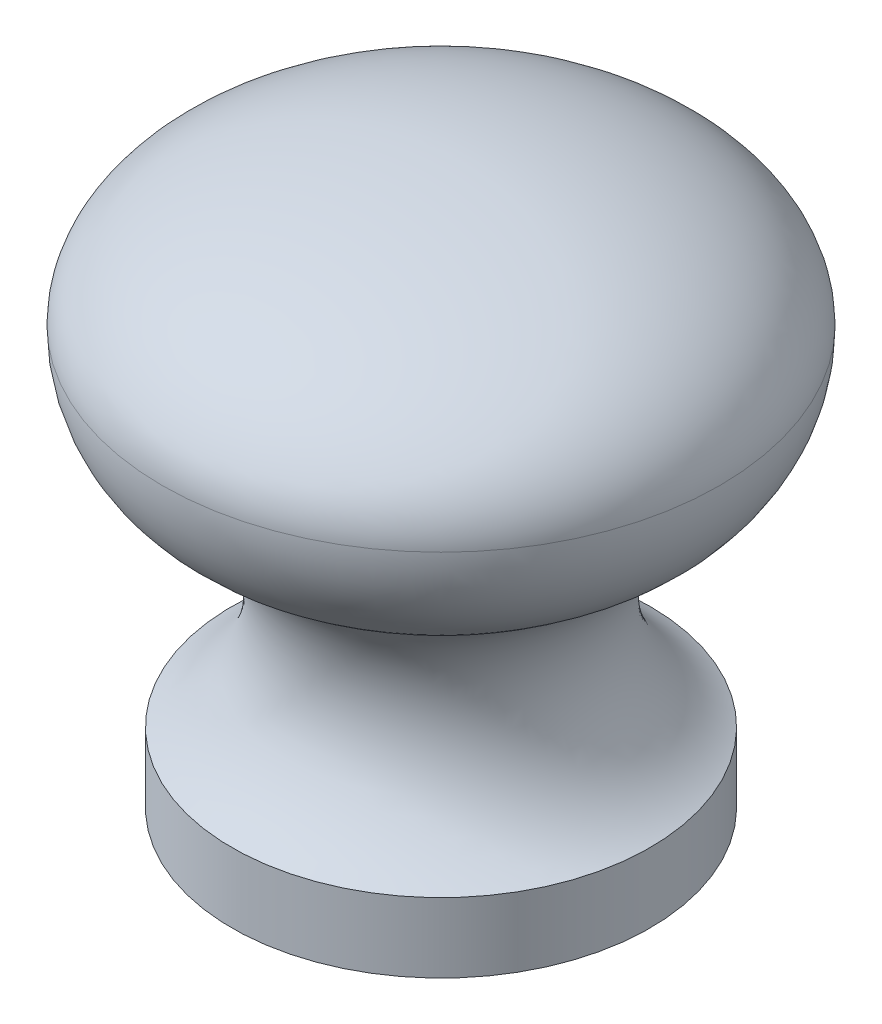
ISO-10303-21;
HEADER;
FILE_DESCRIPTION(('STEP AP214'),'2;1');
FILE_NAME('part.step','',(''),(''),'','','');
FILE_SCHEMA(('AUTOMOTIVE_DESIGN { 1 0 10303 214 1 1 1 1 }'));
ENDSEC;
DATA;
#1=APPLICATION_CONTEXT('core data for automotive mechanical design processes');
#2=APPLICATION_PROTOCOL_DEFINITION('international standard','automotive_design',2000,#1);
#3=PRODUCT_CONTEXT('',#1,'mechanical');
#4=PRODUCT('Part','Part','',(#3));
#5=PRODUCT_RELATED_PRODUCT_CATEGORY('part','',(#4));
#6=PRODUCT_DEFINITION_FORMATION('','',#4);
#7=PRODUCT_DEFINITION_CONTEXT('part definition',#1,'design');
#8=PRODUCT_DEFINITION('design','',#6,#7);
#9=PRODUCT_DEFINITION_SHAPE('','',#8);
#10=(LENGTH_UNIT() NAMED_UNIT(*) SI_UNIT(.MILLI.,.METRE.));
#11=(NAMED_UNIT(*) PLANE_ANGLE_UNIT() SI_UNIT($,.RADIAN.));
#12=(NAMED_UNIT(*) SI_UNIT($,.STERADIAN.) SOLID_ANGLE_UNIT());
#13=UNCERTAINTY_MEASURE_WITH_UNIT(LENGTH_MEASURE(1.E-05),#10,'distance_accuracy_value','');
#14=(GEOMETRIC_REPRESENTATION_CONTEXT(3) GLOBAL_UNCERTAINTY_ASSIGNED_CONTEXT((#13)) GLOBAL_UNIT_ASSIGNED_CONTEXT((#10,
#11,#12)) REPRESENTATION_CONTEXT('',''));
#15=CARTESIAN_POINT('',(0.,0.,0.));
#16=DIRECTION('',(0.,0.,1.));
#17=DIRECTION('',(1.,0.,0.));
#18=AXIS2_PLACEMENT_3D('',#15,#16,#17);
#19=CARTESIAN_POINT('',(0.,19.05,0.));
#20=DIRECTION('',(0.,0.,1.));
#21=DIRECTION('',(-1.,0.,0.));
#22=AXIS2_PLACEMENT_3D('',#19,#20,#21);
#23=ELLIPSE('',#22,12.7,6.35);
#24=TRIMMED_CURVE('',#23,(PARAMETER_VALUE(4.71238898038469)),
(PARAMETER_VALUE(7.85398163397448)),.T.,.PARAMETER.);
#25=CARTESIAN_POINT('',(0.,0.,0.));
#26=DIRECTION('',(0.,-1.,0.));
#27=AXIS1_PLACEMENT('',#25,#26);
#28=SURFACE_OF_REVOLUTION('',#24,#27);
#29=CARTESIAN_POINT('',(0.,19.05,0.));
#30=DIRECTION('',(0.,-1.,0.));
#31=DIRECTION('',(0.,0.,-1.));
#32=AXIS2_PLACEMENT_3D('',#29,#30,#31);
#33=CIRCLE('',#32,12.7);
#34=CARTESIAN_POINT('',(0.,19.05,-12.7));
#35=VERTEX_POINT('',#34);
#36=EDGE_CURVE('E11',#35,#35,#33,.T.);
#37=ORIENTED_EDGE('',*,*,#36,.F.);
#38=EDGE_LOOP('',(#37));
#39=FACE_BOUND('',#38,.T.);
#40=CARTESIAN_POINT('',(0.,25.4,0.));
#41=VERTEX_POINT('',#40);
#42=VERTEX_LOOP('',#41);
#43=FACE_BOUND('',#42,.T.);
#44=ADVANCED_FACE('F32',(#39,#43),#28,.T.);
#45=CARTESIAN_POINT('',(0.,19.05,0.));
#46=DIRECTION('',(0.,-1.,0.));
#47=DIRECTION('',(0.,0.,-1.));
#48=AXIS2_PLACEMENT_3D('',#45,#46,#47);
#49=DEGENERATE_TOROIDAL_SURFACE('',#48,6.35,6.35,.T.);
#50=CARTESIAN_POINT('',(0.,13.4735139297856,0.));
#51=DIRECTION('',(0.,-1.,0.));
#52=DIRECTION('',(0.,0.,-1.));
#53=AXIS2_PLACEMENT_3D('',#50,#51,#52);
#54=CIRCLE('',#53,9.38731840752737);
#55=CARTESIAN_POINT('',(0.,13.4735139297856,-9.38731840752737));
#56=VERTEX_POINT('',#55);
#57=EDGE_CURVE('E40',#56,#56,#54,.T.);
#58=ORIENTED_EDGE('',*,*,#57,.F.);
#59=EDGE_LOOP('',(#58));
#60=FACE_BOUND('',#59,.T.);
#61=ORIENTED_EDGE('',*,*,#36,.T.);
#62=EDGE_LOOP('',(#61));
#63=FACE_BOUND('',#62,.T.);
#64=ADVANCED_FACE('F78',(#60,#63),#49,.T.);
#65=CARTESIAN_POINT('',(0.,8.36056741875679,0.));
#66=DIRECTION('',(0.,-1.,0.));
#67=DIRECTION('',(0.,0.,-1.));
#68=AXIS2_PLACEMENT_3D('',#65,#66,#67);
#69=TOROIDAL_SURFACE('',#68,12.172162906216,5.82216290621605);
#70=ORIENTED_EDGE('',*,*,#57,.T.);
#71=EDGE_LOOP('',(#70));
#72=FACE_BOUND('',#71,.T.);
#73=CARTESIAN_POINT('',(0.,3.175,0.));
#74=DIRECTION('',(0.,-1.,0.));
#75=DIRECTION('',(0.,0.,-1.));
#76=AXIS2_PLACEMENT_3D('',#73,#74,#75);
#77=CIRCLE('',#76,9.525);
#78=CARTESIAN_POINT('',(0.,3.175,-9.525));
#79=VERTEX_POINT('',#78);
#80=EDGE_CURVE('E70',#79,#79,#77,.T.);
#81=ORIENTED_EDGE('',*,*,#80,.F.);
#82=EDGE_LOOP('',(#81));
#83=FACE_BOUND('',#82,.T.);
#84=ADVANCED_FACE('F75',(#72,#83),#69,.F.);
#85=CARTESIAN_POINT('',(0.,0.,0.));
#86=DIRECTION('',(0.,-1.,0.));
#87=DIRECTION('',(0.,0.,-1.));
#88=AXIS2_PLACEMENT_3D('',#85,#86,#87);
#89=CYLINDRICAL_SURFACE('',#88,9.525);
#90=ORIENTED_EDGE('',*,*,#80,.T.);
#91=EDGE_LOOP('',(#90));
#92=FACE_BOUND('',#91,.T.);
#93=CARTESIAN_POINT('',(0.,0.,0.));
#94=DIRECTION('',(0.,-1.,0.));
#95=DIRECTION('',(0.,0.,-1.));
#96=AXIS2_PLACEMENT_3D('',#93,#94,#95);
#97=CIRCLE('',#96,9.525);
#98=CARTESIAN_POINT('',(0.,0.,-9.525));
#99=VERTEX_POINT('',#98);
#100=EDGE_CURVE('E65',#99,#99,#97,.T.);
#101=ORIENTED_EDGE('',*,*,#100,.F.);
#102=EDGE_LOOP('',(#101));
#103=FACE_BOUND('',#102,.T.);
#104=ADVANCED_FACE('F96',(#92,#103),#89,.T.);
#105=CARTESIAN_POINT('',(0.,0.,0.));
#106=DIRECTION('',(0.,-1.,0.));
#107=DIRECTION('',(0.,0.,-1.));
#108=AXIS2_PLACEMENT_3D('',#105,#106,#107);
#109=PLANE('',#108);
#110=CARTESIAN_POINT('',(0.,0.,0.));
#111=DIRECTION('',(0.,-1.,0.));
#112=DIRECTION('',(0.,0.,-1.));
#113=AXIS2_PLACEMENT_3D('',#110,#111,#112);
#114=CIRCLE('',#113,2.0828);
#115=CARTESIAN_POINT('',(0.,0.,-2.0828));
#116=VERTEX_POINT('',#115);
#117=EDGE_CURVE('E63',#116,#116,#114,.T.);
#118=ORIENTED_EDGE('',*,*,#117,.F.);
#119=EDGE_LOOP('',(#118));
#120=FACE_BOUND('',#119,.T.);
#121=ORIENTED_EDGE('',*,*,#100,.T.);
#122=EDGE_LOOP('',(#121));
#123=FACE_BOUND('',#122,.T.);
#124=ADVANCED_FACE('F103',(#120,#123),#109,.T.);
#125=CARTESIAN_POINT('',(0.,0.,0.));
#126=DIRECTION('',(0.,-1.,0.));
#127=DIRECTION('',(0.,0.,-1.));
#128=AXIS2_PLACEMENT_3D('',#125,#126,#127);
#129=CYLINDRICAL_SURFACE('',#128,2.0828);
#130=CARTESIAN_POINT('',(0.,12.7,0.));
#131=DIRECTION('',(0.,-1.,0.));
#132=DIRECTION('',(0.,0.,-1.));
#133=AXIS2_PLACEMENT_3D('',#130,#131,#132);
#134=CIRCLE('',#133,2.0828);
#135=CARTESIAN_POINT('',(0.,12.7,-2.0828));
#136=VERTEX_POINT('',#135);
#137=EDGE_CURVE('E58',#136,#136,#134,.T.);
#138=ORIENTED_EDGE('',*,*,#137,.F.);
#139=EDGE_LOOP('',(#138));
#140=FACE_BOUND('',#139,.T.);
#141=ORIENTED_EDGE('',*,*,#117,.T.);
#142=EDGE_LOOP('',(#141));
#143=FACE_BOUND('',#142,.T.);
#144=ADVANCED_FACE('F111',(#140,#143),#129,.F.);
#145=CARTESIAN_POINT('',(1.7272,12.7,0.));
#146=DIRECTION('',(0.,1.,0.));
#147=DIRECTION('',(0.,0.,1.));
#148=AXIS2_PLACEMENT_3D('',#145,#146,#147);
#149=PLANE('',#148);
#150=CARTESIAN_POINT('',(0.,12.7,0.));
#151=DIRECTION('',(0.,-1.,0.));
#152=DIRECTION('',(0.,0.,-1.));
#153=AXIS2_PLACEMENT_3D('',#150,#151,#152);
#154=CIRCLE('',#153,1.7272);
#155=CARTESIAN_POINT('',(0.,12.7,-1.7272));
#156=VERTEX_POINT('',#155);
#157=EDGE_CURVE('E55',#156,#156,#154,.T.);
#158=ORIENTED_EDGE('',*,*,#157,.F.);
#159=EDGE_LOOP('',(#158));
#160=FACE_BOUND('',#159,.T.);
#161=ORIENTED_EDGE('',*,*,#137,.T.);
#162=EDGE_LOOP('',(#161));
#163=FACE_BOUND('',#162,.T.);
#164=ADVANCED_FACE('F119',(#160,#163),#149,.F.);
#165=CARTESIAN_POINT('',(0.,0.,0.));
#166=DIRECTION('',(0.,-1.,0.));
#167=DIRECTION('',(0.,0.,-1.));
#168=AXIS2_PLACEMENT_3D('',#165,#166,#167);
#169=CYLINDRICAL_SURFACE('',#168,1.7272);
#170=CARTESIAN_POINT('',(0.,15.07744,0.));
#171=DIRECTION('',(0.,-1.,0.));
#172=DIRECTION('',(0.,0.,-1.));
#173=AXIS2_PLACEMENT_3D('',#170,#171,#172);
#174=CIRCLE('',#173,1.7272);
#175=CARTESIAN_POINT('',(0.,15.07744,-1.7272));
#176=VERTEX_POINT('',#175);
#177=EDGE_CURVE('E53',#176,#176,#174,.T.);
#178=ORIENTED_EDGE('',*,*,#177,.F.);
#179=EDGE_LOOP('',(#178));
#180=FACE_BOUND('',#179,.T.);
#181=ORIENTED_EDGE('',*,*,#157,.T.);
#182=EDGE_LOOP('',(#181));
#183=FACE_BOUND('',#182,.T.);
#184=ADVANCED_FACE('F49',(#180,#183),#169,.F.);
#185=CARTESIAN_POINT('',(0.,15.07744,0.));
#186=DIRECTION('',(0.,-1.,0.));
#187=DIRECTION('',(0.,0.,-1.));
#188=AXIS2_PLACEMENT_3D('',#185,#186,#187);
#189=CONICAL_SURFACE('',#188,1.7272,1.02974425867665);
#190=CARTESIAN_POINT('',(0.,16.1152464611844,0.));
#191=VERTEX_POINT('',#190);
#192=VERTEX_LOOP('',#191);
#193=FACE_BOUND('',#192,.T.);
#194=ORIENTED_EDGE('',*,*,#177,.T.);
#195=EDGE_LOOP('',(#194));
#196=FACE_BOUND('',#195,.T.);
#197=ADVANCED_FACE('F46',(#193,#196),#189,.F.);
#198=CLOSED_SHELL('',(#44,#64,#84,#104,#124,#144,#164,#184,#197));
#199=MANIFOLD_SOLID_BREP('B2',#198);
#200=ADVANCED_BREP_SHAPE_REPRESENTATION('',(#18,#199),#14);
#201=SHAPE_DEFINITION_REPRESENTATION(#9,#200);
ENDSEC;
END-ISO-10303-21;
